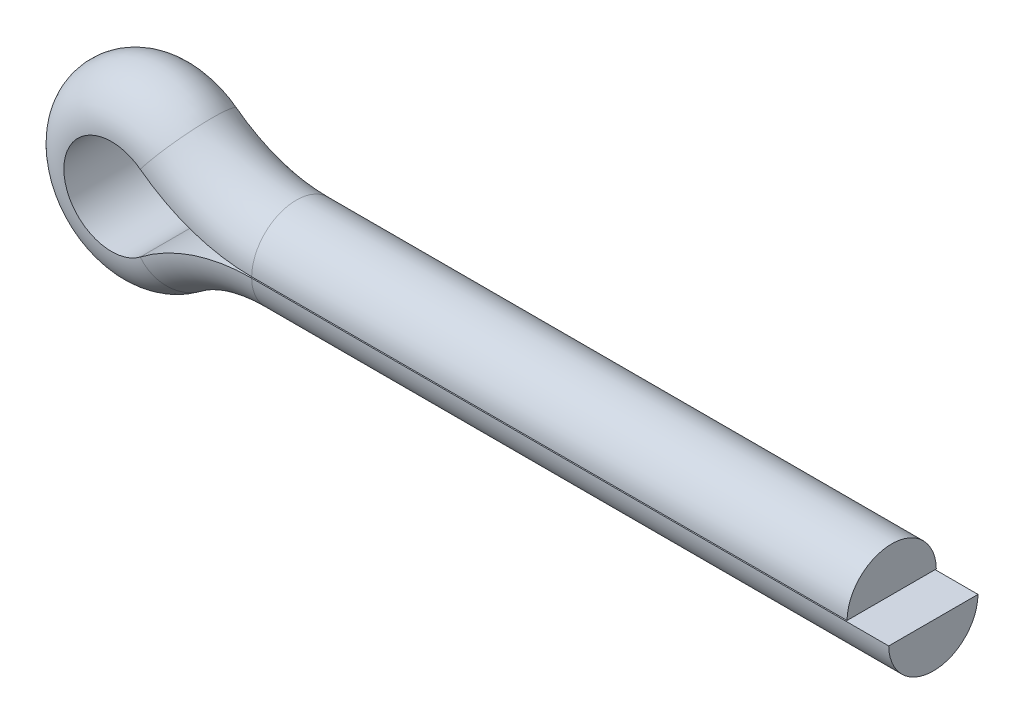
ISO-10303-21;
HEADER;
FILE_DESCRIPTION(('STEP AP214'),'2;1');
FILE_NAME('part.step','',(''),(''),'','','');
FILE_SCHEMA(('AUTOMOTIVE_DESIGN { 1 0 10303 214 1 1 1 1 }'));
ENDSEC;
DATA;
#1=APPLICATION_CONTEXT('core data for automotive mechanical design processes');
#2=APPLICATION_PROTOCOL_DEFINITION('international standard','automotive_design',2000,#1);
#3=PRODUCT_CONTEXT('',#1,'mechanical');
#4=PRODUCT('Part','Part','',(#3));
#5=PRODUCT_RELATED_PRODUCT_CATEGORY('part','',(#4));
#6=PRODUCT_DEFINITION_FORMATION('','',#4);
#7=PRODUCT_DEFINITION_CONTEXT('part definition',#1,'design');
#8=PRODUCT_DEFINITION('design','',#6,#7);
#9=PRODUCT_DEFINITION_SHAPE('','',#8);
#10=(LENGTH_UNIT() NAMED_UNIT(*) SI_UNIT(.MILLI.,.METRE.));
#11=(NAMED_UNIT(*) PLANE_ANGLE_UNIT() SI_UNIT($,.RADIAN.));
#12=(NAMED_UNIT(*) SI_UNIT($,.STERADIAN.) SOLID_ANGLE_UNIT());
#13=UNCERTAINTY_MEASURE_WITH_UNIT(LENGTH_MEASURE(1.E-05),#10,'distance_accuracy_value','');
#14=(GEOMETRIC_REPRESENTATION_CONTEXT(3) GLOBAL_UNCERTAINTY_ASSIGNED_CONTEXT((#13)) GLOBAL_UNIT_ASSIGNED_CONTEXT((#10,
#11,#12)) REPRESENTATION_CONTEXT('',''));
#15=CARTESIAN_POINT('',(0.,0.,0.));
#16=DIRECTION('',(0.,0.,1.));
#17=DIRECTION('',(1.,0.,0.));
#18=AXIS2_PLACEMENT_3D('',#15,#16,#17);
#19=CARTESIAN_POINT('',(0.,0.,0.));
#20=DIRECTION('',(1.,0.,0.));
#21=DIRECTION('',(0.,1.,0.));
#22=AXIS2_PLACEMENT_3D('',#19,#20,#21);
#23=PLANE('',#22);
#24=CARTESIAN_POINT('',(0.,0.,0.));
#25=DIRECTION('',(1.,0.,0.));
#26=DIRECTION('',(0.,0.,-1.));
#27=AXIS2_PLACEMENT_3D('',#24,#25,#26);
#28=CIRCLE('',#27,1.905);
#29=CARTESIAN_POINT('',(0.,0.0254,-1.90483065914007));
#30=VERTEX_POINT('',#29);
#31=CARTESIAN_POINT('',(0.,0.0254,1.90483065914007));
#32=VERTEX_POINT('',#31);
#33=EDGE_CURVE('E11',#30,#32,#28,.T.);
#34=ORIENTED_EDGE('',*,*,#33,.T.);
#35=DIRECTION('',(0.,0.,-1.));
#36=VECTOR('',#35,1.);
#37=CARTESIAN_POINT('',(0.,0.0254,1.90483065914007));
#38=LINE('',#37,#36);
#39=EDGE_CURVE('E151',#32,#30,#38,.T.);
#40=ORIENTED_EDGE('',*,*,#39,.T.);
#41=EDGE_LOOP('',(#34,#40));
#42=FACE_BOUND('',#41,.T.);
#43=ADVANCED_FACE('F17',(#42),#23,.T.);
#44=CARTESIAN_POINT('',(1.778,0.,0.));
#45=DIRECTION('',(-1.,0.,0.));
#46=DIRECTION('',(0.,0.,1.));
#47=AXIS2_PLACEMENT_3D('',#44,#45,#46);
#48=PLANE('',#47);
#49=CARTESIAN_POINT('',(1.778,0.,0.));
#50=DIRECTION('',(-1.,0.,0.));
#51=DIRECTION('',(0.,0.,-1.));
#52=AXIS2_PLACEMENT_3D('',#49,#50,#51);
#53=CIRCLE('',#52,1.905);
#54=CARTESIAN_POINT('',(1.778,-0.0254,-1.90483065914007));
#55=VERTEX_POINT('',#54);
#56=CARTESIAN_POINT('',(1.778,-0.0254,1.90483065914007));
#57=VERTEX_POINT('',#56);
#58=EDGE_CURVE('E79',#55,#57,#53,.T.);
#59=ORIENTED_EDGE('',*,*,#58,.F.);
#60=DIRECTION('',(0.,0.,-1.));
#61=VECTOR('',#60,1.);
#62=CARTESIAN_POINT('',(1.778,-0.0254,1.90483065914007));
#63=LINE('',#62,#61);
#64=EDGE_CURVE('E95',#57,#55,#63,.T.);
#65=ORIENTED_EDGE('',*,*,#64,.F.);
#66=EDGE_LOOP('',(#59,#65));
#67=FACE_BOUND('',#66,.T.);
#68=ADVANCED_FACE('F19',(#67),#48,.F.);
#69=CARTESIAN_POINT('',(0.,0.,0.));
#70=DIRECTION('',(-1.,0.,0.));
#71=DIRECTION('',(0.,1.,0.));
#72=AXIS2_PLACEMENT_3D('',#69,#70,#71);
#73=CYLINDRICAL_SURFACE('',#72,1.905);
#74=DIRECTION('',(-1.,0.,0.));
#75=VECTOR('',#74,1.);
#76=CARTESIAN_POINT('',(0.,0.0254,1.90483065914007));
#77=LINE('',#76,#75);
#78=CARTESIAN_POINT('',(-25.4,0.0253999999999966,1.90483065914007));
#79=VERTEX_POINT('',#78);
#80=EDGE_CURVE('E26',#32,#79,#77,.T.);
#81=ORIENTED_EDGE('',*,*,#80,.F.);
#82=ORIENTED_EDGE('',*,*,#33,.F.);
#83=DIRECTION('',(-1.,0.,0.));
#84=VECTOR('',#83,1.);
#85=CARTESIAN_POINT('',(0.,0.0254,-1.90483065914007));
#86=LINE('',#85,#84);
#87=CARTESIAN_POINT('',(-25.4,0.0253999999999967,-1.90483065914007));
#88=VERTEX_POINT('',#87);
#89=EDGE_CURVE('E143',#30,#88,#86,.T.);
#90=ORIENTED_EDGE('',*,*,#89,.T.);
#91=CARTESIAN_POINT('',(-25.4,0.,0.));
#92=DIRECTION('',(1.,0.,0.));
#93=DIRECTION('',(0.,0.,-1.));
#94=AXIS2_PLACEMENT_3D('',#91,#92,#93);
#95=CIRCLE('',#94,1.905);
#96=EDGE_CURVE('E118',#88,#79,#95,.T.);
#97=ORIENTED_EDGE('',*,*,#96,.T.);
#98=EDGE_LOOP('',(#81,#82,#90,#97));
#99=FACE_BOUND('',#98,.T.);
#100=ADVANCED_FACE('F169',(#99),#73,.T.);
#101=CARTESIAN_POINT('',(0.,0.0254,1.90483065914007));
#102=DIRECTION('',(0.,1.,0.));
#103=DIRECTION('',(1.,0.,0.));
#104=AXIS2_PLACEMENT_3D('',#101,#102,#103);
#105=PLANE('',#104);
#106=DIRECTION('',(0.,0.,-1.));
#107=VECTOR('',#106,1.);
#108=CARTESIAN_POINT('',(-25.4,0.0253999999999966,1.90483065914007));
#109=LINE('',#108,#107);
#110=EDGE_CURVE('E139',#79,#88,#109,.T.);
#111=ORIENTED_EDGE('',*,*,#110,.T.);
#112=ORIENTED_EDGE('',*,*,#89,.F.);
#113=ORIENTED_EDGE('',*,*,#39,.F.);
#114=ORIENTED_EDGE('',*,*,#80,.T.);
#115=EDGE_LOOP('',(#111,#112,#113,#114));
#116=FACE_BOUND('',#115,.T.);
#117=ADVANCED_FACE('F159',(#116),#105,.F.);
#118=CARTESIAN_POINT('',(-25.4,7.8994,0.));
#119=DIRECTION('',(0.,0.,-1.));
#120=DIRECTION('',(-1.,0.,0.));
#121=AXIS2_PLACEMENT_3D('',#118,#119,#120);
#122=CYLINDRICAL_SURFACE('',#121,7.874);
#123=DIRECTION('',(0.,0.,-1.));
#124=VECTOR('',#123,1.);
#125=CARTESIAN_POINT('',(-30.151200500915,1.62038974358974,1.90483065914007));
#126=LINE('',#125,#124);
#127=CARTESIAN_POINT('',(-30.151200500915,1.62038974358975,1.90483065914007));
#128=VERTEX_POINT('',#127);
#129=CARTESIAN_POINT('',(-30.151200500915,1.62038974358975,-1.90483065914007));
#130=VERTEX_POINT('',#129);
#131=EDGE_CURVE('E138',#128,#130,#126,.T.);
#132=ORIENTED_EDGE('',*,*,#131,.T.);
#133=CARTESIAN_POINT('',(-25.4,7.8994,-1.90483065914007));
#134=DIRECTION('',(0.,0.,-1.));
#135=DIRECTION('',(0.,-1.,0.));
#136=AXIS2_PLACEMENT_3D('',#133,#134,#135);
#137=CIRCLE('',#136,7.874);
#138=EDGE_CURVE('E124',#88,#130,#137,.T.);
#139=ORIENTED_EDGE('',*,*,#138,.F.);
#140=ORIENTED_EDGE('',*,*,#110,.F.);
#141=CARTESIAN_POINT('',(-25.4,7.8994,1.90483065914007));
#142=DIRECTION('',(0.,0.,-1.));
#143=DIRECTION('',(0.,-1.,0.));
#144=AXIS2_PLACEMENT_3D('',#141,#142,#143);
#145=CIRCLE('',#144,7.874);
#146=EDGE_CURVE('E102',#79,#128,#145,.T.);
#147=ORIENTED_EDGE('',*,*,#146,.T.);
#148=EDGE_LOOP('',(#132,#139,#140,#147));
#149=FACE_BOUND('',#148,.T.);
#150=ADVANCED_FACE('F164',(#149),#122,.T.);
#151=CARTESIAN_POINT('',(-31.3773167592156,0.,0.));
#152=DIRECTION('',(0.,0.,1.));
#153=DIRECTION('',(-1.,0.,0.));
#154=AXIS2_PLACEMENT_3D('',#151,#152,#153);
#155=TOROIDAL_SURFACE('',#154,2.0066,1.905);
#156=CARTESIAN_POINT('',(-31.3773167592156,0.,1.90483065914007));
#157=DIRECTION('',(0.,0.,1.));
#158=DIRECTION('',(0.603403670423538,0.797435897435902,0.));
#159=AXIS2_PLACEMENT_3D('',#156,#157,#158);
#160=CIRCLE('',#159,2.032);
#161=CARTESIAN_POINT('',(-30.151200500915,-1.62038974358974,1.90483065914007));
#162=VERTEX_POINT('',#161);
#163=EDGE_CURVE('E144',#128,#162,#160,.T.);
#164=ORIENTED_EDGE('',*,*,#163,.F.);
#165=CARTESIAN_POINT('',(-30.1665269541437,1.60013487179488,0.));
#166=DIRECTION('',(0.797435897435897,-0.603403670423545,0.));
#167=DIRECTION('',(0.,0.,-1.));
#168=AXIS2_PLACEMENT_3D('',#165,#166,#167);
#169=CIRCLE('',#168,1.905);
#170=EDGE_CURVE('E111',#130,#128,#169,.T.);
#171=ORIENTED_EDGE('',*,*,#170,.F.);
#172=CARTESIAN_POINT('',(-31.3773167592156,0.,-1.90483065914007));
#173=DIRECTION('',(0.,0.,1.));
#174=DIRECTION('',(0.603403670423539,0.797435897435901,0.));
#175=AXIS2_PLACEMENT_3D('',#172,#173,#174);
#176=CIRCLE('',#175,2.032);
#177=CARTESIAN_POINT('',(-30.151200500915,-1.62038974358974,-1.90483065914007));
#178=VERTEX_POINT('',#177);
#179=EDGE_CURVE('E134',#130,#178,#176,.T.);
#180=ORIENTED_EDGE('',*,*,#179,.T.);
#181=CARTESIAN_POINT('',(-30.1665269541437,-1.60013487179487,0.));
#182=DIRECTION('',(-0.7974358974359,-0.603403670423541,0.));
#183=DIRECTION('',(0.,0.,-1.));
#184=AXIS2_PLACEMENT_3D('',#181,#182,#183);
#185=CIRCLE('',#184,1.905);
#186=EDGE_CURVE('E346',#178,#162,#185,.T.);
#187=ORIENTED_EDGE('',*,*,#186,.T.);
#188=EDGE_LOOP('',(#164,#171,#180,#187));
#189=FACE_BOUND('',#188,.T.);
#190=ADVANCED_FACE('F215',(#189),#155,.T.);
#191=CARTESIAN_POINT('',(-31.3773167592156,0.,0.));
#192=DIRECTION('',(0.,0.,1.));
#193=DIRECTION('',(-1.,0.,0.));
#194=AXIS2_PLACEMENT_3D('',#191,#192,#193);
#195=CYLINDRICAL_SURFACE('',#194,2.032);
#196=DIRECTION('',(0.,0.,-1.));
#197=VECTOR('',#196,1.);
#198=CARTESIAN_POINT('',(-30.151200500915,-1.62038974358974,1.90483065914007));
#199=LINE('',#198,#197);
#200=EDGE_CURVE('E91',#162,#178,#199,.T.);
#201=ORIENTED_EDGE('',*,*,#200,.T.);
#202=ORIENTED_EDGE('',*,*,#179,.F.);
#203=ORIENTED_EDGE('',*,*,#131,.F.);
#204=ORIENTED_EDGE('',*,*,#163,.T.);
#205=EDGE_LOOP('',(#201,#202,#203,#204));
#206=FACE_BOUND('',#205,.T.);
#207=ADVANCED_FACE('F225',(#206),#195,.F.);
#208=CARTESIAN_POINT('',(-25.4,-7.8994,0.));
#209=DIRECTION('',(0.,0.,-1.));
#210=DIRECTION('',(-1.,0.,0.));
#211=AXIS2_PLACEMENT_3D('',#208,#209,#210);
#212=CYLINDRICAL_SURFACE('',#211,7.874);
#213=DIRECTION('',(0.,0.,-1.));
#214=VECTOR('',#213,1.);
#215=CARTESIAN_POINT('',(-25.4,-0.0253999999999966,1.90483065914007));
#216=LINE('',#215,#214);
#217=CARTESIAN_POINT('',(-25.4,-0.0253999999999966,1.90483065914007));
#218=VERTEX_POINT('',#217);
#219=CARTESIAN_POINT('',(-25.4,-0.0253999999999966,-1.90483065914007));
#220=VERTEX_POINT('',#219);
#221=EDGE_CURVE('E97',#218,#220,#216,.T.);
#222=ORIENTED_EDGE('',*,*,#221,.T.);
#223=CARTESIAN_POINT('',(-25.4,-7.8994,-1.90483065914007));
#224=DIRECTION('',(0.,0.,-1.));
#225=DIRECTION('',(-0.603403670423544,0.797435897435897,0.));
#226=AXIS2_PLACEMENT_3D('',#223,#224,#225);
#227=CIRCLE('',#226,7.874);
#228=EDGE_CURVE('E115',#178,#220,#227,.T.);
#229=ORIENTED_EDGE('',*,*,#228,.F.);
#230=ORIENTED_EDGE('',*,*,#200,.F.);
#231=CARTESIAN_POINT('',(-25.4,-7.8994,1.90483065914007));
#232=DIRECTION('',(0.,0.,-1.));
#233=DIRECTION('',(-0.603403670423544,0.797435897435897,0.));
#234=AXIS2_PLACEMENT_3D('',#231,#232,#233);
#235=CIRCLE('',#234,7.874);
#236=EDGE_CURVE('E116',#162,#218,#235,.T.);
#237=ORIENTED_EDGE('',*,*,#236,.T.);
#238=EDGE_LOOP('',(#222,#229,#230,#237));
#239=FACE_BOUND('',#238,.T.);
#240=ADVANCED_FACE('F235',(#239),#212,.T.);
#241=CARTESIAN_POINT('',(-25.4,0.,0.));
#242=DIRECTION('',(1.,0.,0.));
#243=DIRECTION('',(0.,-1.,0.));
#244=AXIS2_PLACEMENT_3D('',#241,#242,#243);
#245=CYLINDRICAL_SURFACE('',#244,1.905);
#246=DIRECTION('',(1.,0.,0.));
#247=VECTOR('',#246,1.);
#248=CARTESIAN_POINT('',(-25.4,-0.0253999999999984,1.90483065914007));
#249=LINE('',#248,#247);
#250=EDGE_CURVE('E83',#218,#57,#249,.T.);
#251=ORIENTED_EDGE('',*,*,#250,.F.);
#252=CARTESIAN_POINT('',(-25.4,0.,0.));
#253=DIRECTION('',(-1.,0.,0.));
#254=DIRECTION('',(0.,0.,-1.));
#255=AXIS2_PLACEMENT_3D('',#252,#253,#254);
#256=CIRCLE('',#255,1.905);
#257=EDGE_CURVE('E119',#220,#218,#256,.T.);
#258=ORIENTED_EDGE('',*,*,#257,.F.);
#259=DIRECTION('',(1.,0.,0.));
#260=VECTOR('',#259,1.);
#261=CARTESIAN_POINT('',(-25.4,-0.0253999999999985,-1.90483065914007));
#262=LINE('',#261,#260);
#263=EDGE_CURVE('E86',#220,#55,#262,.T.);
#264=ORIENTED_EDGE('',*,*,#263,.T.);
#265=ORIENTED_EDGE('',*,*,#58,.T.);
#266=EDGE_LOOP('',(#251,#258,#264,#265));
#267=FACE_BOUND('',#266,.T.);
#268=ADVANCED_FACE('F81',(#267),#245,.T.);
#269=CARTESIAN_POINT('',(-25.4,-0.0253999999999984,1.90483065914007));
#270=DIRECTION('',(0.,-1.,0.));
#271=DIRECTION('',(-1.,0.,0.));
#272=AXIS2_PLACEMENT_3D('',#269,#270,#271);
#273=PLANE('',#272);
#274=ORIENTED_EDGE('',*,*,#64,.T.);
#275=ORIENTED_EDGE('',*,*,#263,.F.);
#276=ORIENTED_EDGE('',*,*,#221,.F.);
#277=ORIENTED_EDGE('',*,*,#250,.T.);
#278=EDGE_LOOP('',(#274,#275,#276,#277));
#279=FACE_BOUND('',#278,.T.);
#280=ADVANCED_FACE('F94',(#279),#273,.F.);
#281=CARTESIAN_POINT('',(-25.4,7.8994,0.));
#282=DIRECTION('',(0.,0.,-1.));
#283=DIRECTION('',(-1.,0.,0.));
#284=AXIS2_PLACEMENT_3D('',#281,#282,#283);
#285=TOROIDAL_SURFACE('',#284,7.8994,1.905);
#286=ORIENTED_EDGE('',*,*,#96,.F.);
#287=ORIENTED_EDGE('',*,*,#138,.T.);
#288=ORIENTED_EDGE('',*,*,#170,.T.);
#289=ORIENTED_EDGE('',*,*,#146,.F.);
#290=EDGE_LOOP('',(#286,#287,#288,#289));
#291=FACE_BOUND('',#290,.T.);
#292=ADVANCED_FACE('F167',(#291),#285,.T.);
#293=CARTESIAN_POINT('',(-25.4,-7.8994,0.));
#294=DIRECTION('',(0.,0.,-1.));
#295=DIRECTION('',(-1.,0.,0.));
#296=AXIS2_PLACEMENT_3D('',#293,#294,#295);
#297=TOROIDAL_SURFACE('',#296,7.8994,1.905);
#298=ORIENTED_EDGE('',*,*,#186,.F.);
#299=ORIENTED_EDGE('',*,*,#228,.T.);
#300=ORIENTED_EDGE('',*,*,#257,.T.);
#301=ORIENTED_EDGE('',*,*,#236,.F.);
#302=EDGE_LOOP('',(#298,#299,#300,#301));
#303=FACE_BOUND('',#302,.T.);
#304=ADVANCED_FACE('F274',(#303),#297,.T.);
#305=CLOSED_SHELL('',(#43,#68,#100,#117,#150,#190,#207,#240,#268,#280,#292,#304));
#306=MANIFOLD_SOLID_BREP('B1',#305);
#307=ADVANCED_BREP_SHAPE_REPRESENTATION('',(#18,#306),#14);
#308=SHAPE_DEFINITION_REPRESENTATION(#9,#307);
ENDSEC;
END-ISO-10303-21;
